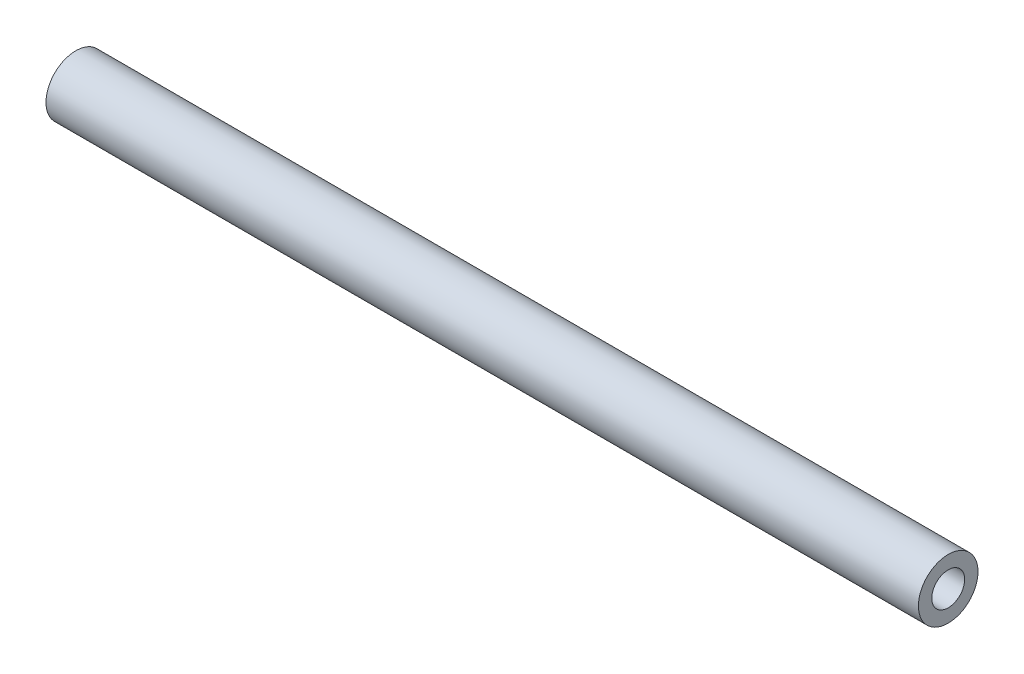
ISO-10303-21;
HEADER;
FILE_DESCRIPTION(('STEP AP214'),'2;1');
FILE_NAME('part.step','',(''),(''),'','','');
FILE_SCHEMA(('AUTOMOTIVE_DESIGN { 1 0 10303 214 1 1 1 1 }'));
ENDSEC;
DATA;
#1=APPLICATION_CONTEXT('core data for automotive mechanical design processes');
#2=APPLICATION_PROTOCOL_DEFINITION('international standard','automotive_design',2000,#1);
#3=PRODUCT_CONTEXT('',#1,'mechanical');
#4=PRODUCT('Part','Part','',(#3));
#5=PRODUCT_RELATED_PRODUCT_CATEGORY('part','',(#4));
#6=PRODUCT_DEFINITION_FORMATION('','',#4);
#7=PRODUCT_DEFINITION_CONTEXT('part definition',#1,'design');
#8=PRODUCT_DEFINITION('design','',#6,#7);
#9=PRODUCT_DEFINITION_SHAPE('','',#8);
#10=(LENGTH_UNIT() NAMED_UNIT(*) SI_UNIT(.MILLI.,.METRE.));
#11=(NAMED_UNIT(*) PLANE_ANGLE_UNIT() SI_UNIT($,.RADIAN.));
#12=(NAMED_UNIT(*) SI_UNIT($,.STERADIAN.) SOLID_ANGLE_UNIT());
#13=UNCERTAINTY_MEASURE_WITH_UNIT(LENGTH_MEASURE(1.E-05),#10,'distance_accuracy_value','');
#14=(GEOMETRIC_REPRESENTATION_CONTEXT(3) GLOBAL_UNCERTAINTY_ASSIGNED_CONTEXT((#13)) GLOBAL_UNIT_ASSIGNED_CONTEXT((#10,
#11,#12)) REPRESENTATION_CONTEXT('',''));
#15=CARTESIAN_POINT('',(0.,0.,0.));
#16=DIRECTION('',(0.,0.,1.));
#17=DIRECTION('',(1.,0.,0.));
#18=AXIS2_PLACEMENT_3D('',#15,#16,#17);
#19=CARTESIAN_POINT('',(45.212,0.,0.));
#20=DIRECTION('',(1.,0.,0.));
#21=DIRECTION('',(0.,0.,-1.));
#22=AXIS2_PLACEMENT_3D('',#19,#20,#21);
#23=PLANE('',#22);
#24=CARTESIAN_POINT('',(45.212,0.,0.));
#25=DIRECTION('',(1.,0.,0.));
#26=DIRECTION('',(0.,0.,-1.));
#27=AXIS2_PLACEMENT_3D('',#24,#25,#26);
#28=CIRCLE('',#27,1.5875);
#29=CARTESIAN_POINT('',(45.212,0.,-1.5875));
#30=VERTEX_POINT('',#29);
#31=EDGE_CURVE('E10',#30,#30,#28,.T.);
#32=ORIENTED_EDGE('',*,*,#31,.T.);
#33=EDGE_LOOP('',(#32));
#34=FACE_BOUND('',#33,.T.);
#35=CARTESIAN_POINT('',(45.212,0.,0.));
#36=DIRECTION('',(1.,0.,0.));
#37=DIRECTION('',(0.,0.,-1.));
#38=AXIS2_PLACEMENT_3D('',#35,#36,#37);
#39=CIRCLE('',#38,0.8763);
#40=CARTESIAN_POINT('',(45.212,0.,-0.8763));
#41=VERTEX_POINT('',#40);
#42=EDGE_CURVE('E42',#41,#41,#39,.T.);
#43=ORIENTED_EDGE('',*,*,#42,.F.);
#44=EDGE_LOOP('',(#43));
#45=FACE_BOUND('',#44,.T.);
#46=ADVANCED_FACE('F35',(#34,#45),#23,.T.);
#47=CARTESIAN_POINT('',(45.212,0.,0.));
#48=DIRECTION('',(-1.,0.,0.));
#49=DIRECTION('',(0.,0.,1.));
#50=AXIS2_PLACEMENT_3D('',#47,#48,#49);
#51=CYLINDRICAL_SURFACE('',#50,1.5875);
#52=ORIENTED_EDGE('',*,*,#31,.F.);
#53=EDGE_LOOP('',(#52));
#54=FACE_BOUND('',#53,.T.);
#55=CARTESIAN_POINT('',(-1.27,0.,0.));
#56=DIRECTION('',(-1.,0.,0.));
#57=DIRECTION('',(0.,0.,1.));
#58=AXIS2_PLACEMENT_3D('',#55,#56,#57);
#59=CIRCLE('',#58,1.5875);
#60=CARTESIAN_POINT('',(-1.27,0.,1.5875));
#61=VERTEX_POINT('',#60);
#62=EDGE_CURVE('E46',#61,#61,#59,.T.);
#63=ORIENTED_EDGE('',*,*,#62,.F.);
#64=EDGE_LOOP('',(#63));
#65=FACE_BOUND('',#64,.T.);
#66=ADVANCED_FACE('F37',(#54,#65),#51,.T.);
#67=CARTESIAN_POINT('',(45.212,0.,0.));
#68=DIRECTION('',(-1.,0.,0.));
#69=DIRECTION('',(0.,0.,1.));
#70=AXIS2_PLACEMENT_3D('',#67,#68,#69);
#71=CYLINDRICAL_SURFACE('',#70,0.8763);
#72=ORIENTED_EDGE('',*,*,#42,.T.);
#73=EDGE_LOOP('',(#72));
#74=FACE_BOUND('',#73,.T.);
#75=CARTESIAN_POINT('',(-1.27,0.,0.));
#76=DIRECTION('',(-1.,0.,0.));
#77=DIRECTION('',(0.,0.,1.));
#78=AXIS2_PLACEMENT_3D('',#75,#76,#77);
#79=CIRCLE('',#78,0.8763);
#80=CARTESIAN_POINT('',(-1.27,0.,0.8763));
#81=VERTEX_POINT('',#80);
#82=EDGE_CURVE('E50',#81,#81,#79,.T.);
#83=ORIENTED_EDGE('',*,*,#82,.T.);
#84=EDGE_LOOP('',(#83));
#85=FACE_BOUND('',#84,.T.);
#86=ADVANCED_FACE('F56',(#74,#85),#71,.F.);
#87=CARTESIAN_POINT('',(-1.27,0.,0.));
#88=DIRECTION('',(-1.,0.,0.));
#89=DIRECTION('',(0.,0.,1.));
#90=AXIS2_PLACEMENT_3D('',#87,#88,#89);
#91=PLANE('',#90);
#92=ORIENTED_EDGE('',*,*,#62,.T.);
#93=EDGE_LOOP('',(#92));
#94=FACE_BOUND('',#93,.T.);
#95=ORIENTED_EDGE('',*,*,#82,.F.);
#96=EDGE_LOOP('',(#95));
#97=FACE_BOUND('',#96,.T.);
#98=ADVANCED_FACE('F58',(#94,#97),#91,.T.);
#99=CLOSED_SHELL('',(#46,#66,#86,#98));
#100=MANIFOLD_SOLID_BREP('B2',#99);
#101=ADVANCED_BREP_SHAPE_REPRESENTATION('',(#18,#100),#14);
#102=SHAPE_DEFINITION_REPRESENTATION(#9,#101);
ENDSEC;
END-ISO-10303-21;
